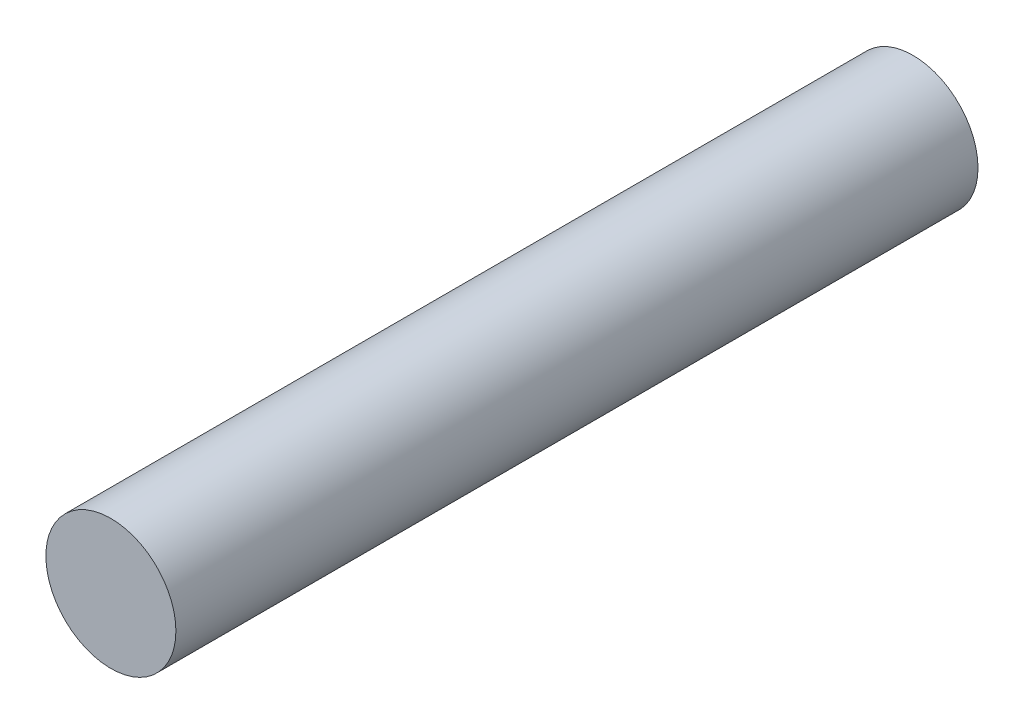
ISO-10303-21;
HEADER;
FILE_DESCRIPTION(('STEP AP214'),'2;1');
FILE_NAME('part.step','',(''),(''),'','','');
FILE_SCHEMA(('AUTOMOTIVE_DESIGN { 1 0 10303 214 1 1 1 1 }'));
ENDSEC;
DATA;
#1=APPLICATION_CONTEXT('core data for automotive mechanical design processes');
#2=APPLICATION_PROTOCOL_DEFINITION('international standard','automotive_design',2000,#1);
#3=PRODUCT_CONTEXT('',#1,'mechanical');
#4=PRODUCT('Part','Part','',(#3));
#5=PRODUCT_RELATED_PRODUCT_CATEGORY('part','',(#4));
#6=PRODUCT_DEFINITION_FORMATION('','',#4);
#7=PRODUCT_DEFINITION_CONTEXT('part definition',#1,'design');
#8=PRODUCT_DEFINITION('design','',#6,#7);
#9=PRODUCT_DEFINITION_SHAPE('','',#8);
#10=(LENGTH_UNIT() NAMED_UNIT(*) SI_UNIT(.MILLI.,.METRE.));
#11=(NAMED_UNIT(*) PLANE_ANGLE_UNIT() SI_UNIT($,.RADIAN.));
#12=(NAMED_UNIT(*) SI_UNIT($,.STERADIAN.) SOLID_ANGLE_UNIT());
#13=UNCERTAINTY_MEASURE_WITH_UNIT(LENGTH_MEASURE(1.E-05),#10,'distance_accuracy_value','');
#14=(GEOMETRIC_REPRESENTATION_CONTEXT(3) GLOBAL_UNCERTAINTY_ASSIGNED_CONTEXT((#13)) GLOBAL_UNIT_ASSIGNED_CONTEXT((#10,
#11,#12)) REPRESENTATION_CONTEXT('',''));
#15=CARTESIAN_POINT('',(0.,0.,0.));
#16=DIRECTION('',(0.,0.,1.));
#17=DIRECTION('',(1.,0.,0.));
#18=AXIS2_PLACEMENT_3D('',#15,#16,#17);
#19=CARTESIAN_POINT('',(0.,0.,8.02));
#20=DIRECTION('',(0.,0.,-1.));
#21=DIRECTION('',(-1.,0.,0.));
#22=AXIS2_PLACEMENT_3D('',#19,#20,#21);
#23=CYLINDRICAL_SURFACE('',#22,0.650000000000001);
#24=CARTESIAN_POINT('',(0.,0.,8.02));
#25=DIRECTION('',(0.,0.,1.));
#26=DIRECTION('',(1.,0.,0.));
#27=AXIS2_PLACEMENT_3D('',#24,#25,#26);
#28=CIRCLE('',#27,0.650000000000001);
#29=CARTESIAN_POINT('',(0.650000000000001,0.,8.02));
#30=VERTEX_POINT('',#29);
#31=EDGE_CURVE('E10',#30,#30,#28,.T.);
#32=ORIENTED_EDGE('',*,*,#31,.F.);
#33=EDGE_LOOP('',(#32));
#34=FACE_BOUND('',#33,.T.);
#35=CARTESIAN_POINT('',(0.,0.,0.));
#36=DIRECTION('',(0.,0.,1.));
#37=DIRECTION('',(1.,0.,0.));
#38=AXIS2_PLACEMENT_3D('',#35,#36,#37);
#39=CIRCLE('',#38,0.650000000000001);
#40=CARTESIAN_POINT('',(0.650000000000001,0.,0.));
#41=VERTEX_POINT('',#40);
#42=EDGE_CURVE('E32',#41,#41,#39,.T.);
#43=ORIENTED_EDGE('',*,*,#42,.T.);
#44=EDGE_LOOP('',(#43));
#45=FACE_BOUND('',#44,.T.);
#46=ADVANCED_FACE('F29',(#34,#45),#23,.T.);
#47=CARTESIAN_POINT('',(0.,0.,8.02));
#48=DIRECTION('',(0.,0.,1.));
#49=DIRECTION('',(1.,0.,0.));
#50=AXIS2_PLACEMENT_3D('',#47,#48,#49);
#51=PLANE('',#50);
#52=ORIENTED_EDGE('',*,*,#31,.T.);
#53=EDGE_LOOP('',(#52));
#54=FACE_BOUND('',#53,.T.);
#55=ADVANCED_FACE('F44',(#54),#51,.T.);
#56=CARTESIAN_POINT('',(0.,0.,0.));
#57=DIRECTION('',(0.,0.,1.));
#58=DIRECTION('',(1.,0.,0.));
#59=AXIS2_PLACEMENT_3D('',#56,#57,#58);
#60=PLANE('',#59);
#61=ORIENTED_EDGE('',*,*,#42,.F.);
#62=EDGE_LOOP('',(#61));
#63=FACE_BOUND('',#62,.T.);
#64=ADVANCED_FACE('F42',(#63),#60,.F.);
#65=CLOSED_SHELL('',(#46,#55,#64));
#66=MANIFOLD_SOLID_BREP('B2',#65);
#67=ADVANCED_BREP_SHAPE_REPRESENTATION('',(#18,#66),#14);
#68=SHAPE_DEFINITION_REPRESENTATION(#9,#67);
ENDSEC;
END-ISO-10303-21;
